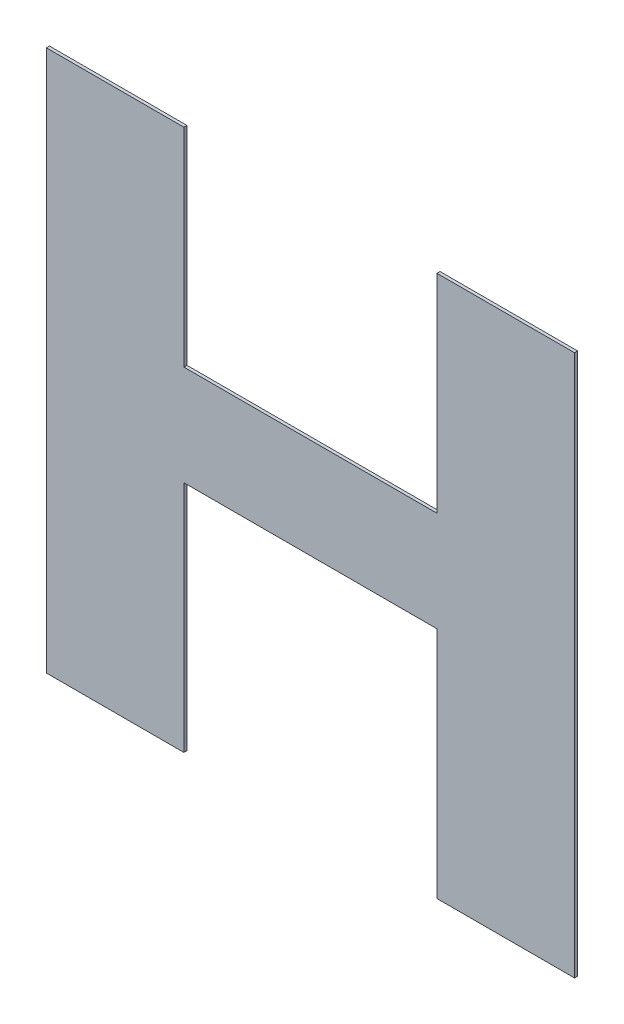
ISO-10303-21;
HEADER;
FILE_DESCRIPTION(('STEP AP214'),'2;1');
FILE_NAME('part.step','',(''),(''),'','','');
FILE_SCHEMA(('AUTOMOTIVE_DESIGN { 1 0 10303 214 1 1 1 1 }'));
ENDSEC;
DATA;
#1=APPLICATION_CONTEXT('core data for automotive mechanical design processes');
#2=APPLICATION_PROTOCOL_DEFINITION('international standard','automotive_design',2000,#1);
#3=PRODUCT_CONTEXT('',#1,'mechanical');
#4=PRODUCT('Part','Part','',(#3));
#5=PRODUCT_RELATED_PRODUCT_CATEGORY('part','',(#4));
#6=PRODUCT_DEFINITION_FORMATION('','',#4);
#7=PRODUCT_DEFINITION_CONTEXT('part definition',#1,'design');
#8=PRODUCT_DEFINITION('design','',#6,#7);
#9=PRODUCT_DEFINITION_SHAPE('','',#8);
#10=(LENGTH_UNIT() NAMED_UNIT(*) SI_UNIT(.MILLI.,.METRE.));
#11=(NAMED_UNIT(*) PLANE_ANGLE_UNIT() SI_UNIT($,.RADIAN.));
#12=(NAMED_UNIT(*) SI_UNIT($,.STERADIAN.) SOLID_ANGLE_UNIT());
#13=UNCERTAINTY_MEASURE_WITH_UNIT(LENGTH_MEASURE(1.E-05),#10,'distance_accuracy_value','');
#14=(GEOMETRIC_REPRESENTATION_CONTEXT(3) GLOBAL_UNCERTAINTY_ASSIGNED_CONTEXT((#13)) GLOBAL_UNIT_ASSIGNED_CONTEXT((#10,
#11,#12)) REPRESENTATION_CONTEXT('',''));
#15=CARTESIAN_POINT('',(0.,0.,0.));
#16=DIRECTION('',(0.,0.,1.));
#17=DIRECTION('',(1.,0.,0.));
#18=AXIS2_PLACEMENT_3D('',#15,#16,#17);
#19=CARTESIAN_POINT('',(-0.0548329304740127,0.85207054274705,0.00045));
#20=DIRECTION('',(0.,1.,0.));
#21=DIRECTION('',(0.,0.,1.));
#22=AXIS2_PLACEMENT_3D('',#19,#20,#21);
#23=PLANE('',#22);
#24=DIRECTION('',(0.,0.,1.));
#25=VECTOR('',#24,1.);
#26=CARTESIAN_POINT('',(-0.0648358536990002,0.85207054274705,0.));
#27=LINE('',#26,#25);
#28=CARTESIAN_POINT('',(-0.0648358536990002,0.85207054274705,0.));
#29=VERTEX_POINT('',#28);
#30=CARTESIAN_POINT('',(-0.0648358536990002,0.85207054274705,0.00045));
#31=VERTEX_POINT('',#30);
#32=EDGE_CURVE('E11',#29,#31,#27,.T.);
#33=ORIENTED_EDGE('',*,*,#32,.T.);
#34=DIRECTION('',(1.,0.,0.));
#35=VECTOR('',#34,1.);
#36=CARTESIAN_POINT('',(-0.0648358536990002,0.85207054274705,0.00045));
#37=LINE('',#36,#35);
#38=CARTESIAN_POINT('',(-0.0448300072490252,0.85207054274705,0.00045));
#39=VERTEX_POINT('',#38);
#40=EDGE_CURVE('E199',#31,#39,#37,.T.);
#41=ORIENTED_EDGE('',*,*,#40,.T.);
#42=DIRECTION('',(0.,0.,1.));
#43=VECTOR('',#42,1.);
#44=CARTESIAN_POINT('',(-0.0448300072490252,0.85207054274705,0.));
#45=LINE('',#44,#43);
#46=CARTESIAN_POINT('',(-0.0448300072490252,0.85207054274705,0.));
#47=VERTEX_POINT('',#46);
#48=EDGE_CURVE('E24',#47,#39,#45,.T.);
#49=ORIENTED_EDGE('',*,*,#48,.F.);
#50=DIRECTION('',(1.,0.,0.));
#51=VECTOR('',#50,1.);
#52=CARTESIAN_POINT('',(-0.0648358536990002,0.85207054274705,0.));
#53=LINE('',#52,#51);
#54=EDGE_CURVE('E188',#29,#47,#53,.T.);
#55=ORIENTED_EDGE('',*,*,#54,.F.);
#56=EDGE_LOOP('',(#33,#41,#49,#55));
#57=FACE_BOUND('',#56,.T.);
#58=ADVANCED_FACE('F17',(#57),#23,.T.);
#59=CARTESIAN_POINT('',(-0.0448300072490252,0.836954923689525,0.00045));
#60=DIRECTION('',(1.,0.,0.));
#61=DIRECTION('',(0.,0.,-1.));
#62=AXIS2_PLACEMENT_3D('',#59,#60,#61);
#63=PLANE('',#62);
#64=ORIENTED_EDGE('',*,*,#48,.T.);
#65=DIRECTION('',(0.,-1.,0.));
#66=VECTOR('',#65,1.);
#67=CARTESIAN_POINT('',(-0.0448300072490252,0.85207054274705,0.00045));
#68=LINE('',#67,#66);
#69=CARTESIAN_POINT('',(-0.0448300072490252,0.821839304632,0.00045));
#70=VERTEX_POINT('',#69);
#71=EDGE_CURVE('E195',#39,#70,#68,.T.);
#72=ORIENTED_EDGE('',*,*,#71,.T.);
#73=DIRECTION('',(0.,0.,1.));
#74=VECTOR('',#73,1.);
#75=CARTESIAN_POINT('',(-0.0448300072490252,0.821839304632,0.));
#76=LINE('',#75,#74);
#77=CARTESIAN_POINT('',(-0.0448300072490252,0.821839304632,0.));
#78=VERTEX_POINT('',#77);
#79=EDGE_CURVE('E197',#78,#70,#76,.T.);
#80=ORIENTED_EDGE('',*,*,#79,.F.);
#81=DIRECTION('',(0.,-1.,0.));
#82=VECTOR('',#81,1.);
#83=CARTESIAN_POINT('',(-0.0448300072490252,0.85207054274705,0.));
#84=LINE('',#83,#82);
#85=EDGE_CURVE('E180',#47,#78,#84,.T.);
#86=ORIENTED_EDGE('',*,*,#85,.F.);
#87=EDGE_LOOP('',(#64,#72,#80,#86));
#88=FACE_BOUND('',#87,.T.);
#89=ADVANCED_FACE('F206',(#88),#63,.T.);
#90=CARTESIAN_POINT('',(-0.0264129244489877,0.821839304632,0.00045));
#91=DIRECTION('',(0.,1.,0.));
#92=DIRECTION('',(0.,0.,1.));
#93=AXIS2_PLACEMENT_3D('',#90,#91,#92);
#94=PLANE('',#93);
#95=ORIENTED_EDGE('',*,*,#79,.T.);
#96=DIRECTION('',(1.,0.,0.));
#97=VECTOR('',#96,1.);
#98=CARTESIAN_POINT('',(-0.0448300072490252,0.821839304632,0.00045));
#99=LINE('',#98,#97);
#100=CARTESIAN_POINT('',(-0.00799584164895018,0.821839304632,0.00045));
#101=VERTEX_POINT('',#100);
#102=EDGE_CURVE('E190',#70,#101,#99,.T.);
#103=ORIENTED_EDGE('',*,*,#102,.T.);
#104=DIRECTION('',(0.,0.,1.));
#105=VECTOR('',#104,1.);
#106=CARTESIAN_POINT('',(-0.00799584164895018,0.821839304632,0.));
#107=LINE('',#106,#105);
#108=CARTESIAN_POINT('',(-0.00799584164895018,0.821839304632,0.));
#109=VERTEX_POINT('',#108);
#110=EDGE_CURVE('E193',#109,#101,#107,.T.);
#111=ORIENTED_EDGE('',*,*,#110,.F.);
#112=DIRECTION('',(1.,0.,0.));
#113=VECTOR('',#112,1.);
#114=CARTESIAN_POINT('',(-0.0448300072490252,0.821839304632,0.));
#115=LINE('',#114,#113);
#116=EDGE_CURVE('E172',#78,#109,#115,.T.);
#117=ORIENTED_EDGE('',*,*,#116,.F.);
#118=EDGE_LOOP('',(#95,#103,#111,#117));
#119=FACE_BOUND('',#118,.T.);
#120=ADVANCED_FACE('F209',(#119),#94,.T.);
#121=CARTESIAN_POINT('',(-0.00799584164895018,0.836954923689525,0.00045));
#122=DIRECTION('',(-1.,0.,0.));
#123=DIRECTION('',(0.,0.,1.));
#124=AXIS2_PLACEMENT_3D('',#121,#122,#123);
#125=PLANE('',#124);
#126=ORIENTED_EDGE('',*,*,#110,.T.);
#127=DIRECTION('',(0.,1.,0.));
#128=VECTOR('',#127,1.);
#129=CARTESIAN_POINT('',(-0.00799584164895018,0.821839304632,0.00045));
#130=LINE('',#129,#128);
#131=CARTESIAN_POINT('',(-0.00799584164895018,0.85207054274705,0.00045));
#132=VERTEX_POINT('',#131);
#133=EDGE_CURVE('E183',#101,#132,#130,.T.);
#134=ORIENTED_EDGE('',*,*,#133,.T.);
#135=DIRECTION('',(0.,0.,1.));
#136=VECTOR('',#135,1.);
#137=CARTESIAN_POINT('',(-0.00799584164895018,0.85207054274705,0.));
#138=LINE('',#137,#136);
#139=CARTESIAN_POINT('',(-0.00799584164895018,0.85207054274705,0.));
#140=VERTEX_POINT('',#139);
#141=EDGE_CURVE('E186',#140,#132,#138,.T.);
#142=ORIENTED_EDGE('',*,*,#141,.F.);
#143=DIRECTION('',(0.,1.,0.));
#144=VECTOR('',#143,1.);
#145=CARTESIAN_POINT('',(-0.00799584164895018,0.821839304632,0.));
#146=LINE('',#145,#144);
#147=EDGE_CURVE('E164',#109,#140,#146,.T.);
#148=ORIENTED_EDGE('',*,*,#147,.F.);
#149=EDGE_LOOP('',(#126,#134,#142,#148));
#150=FACE_BOUND('',#149,.T.);
#151=ADVANCED_FACE('F213',(#150),#125,.T.);
#152=CARTESIAN_POINT('',(0.00201012957599981,0.85207054274705,0.00045));
#153=DIRECTION('',(0.,1.,0.));
#154=DIRECTION('',(0.,0.,1.));
#155=AXIS2_PLACEMENT_3D('',#152,#153,#154);
#156=PLANE('',#155);
#157=ORIENTED_EDGE('',*,*,#141,.T.);
#158=DIRECTION('',(1.,0.,0.));
#159=VECTOR('',#158,1.);
#160=CARTESIAN_POINT('',(-0.00799584164895018,0.85207054274705,0.00045));
#161=LINE('',#160,#159);
#162=CARTESIAN_POINT('',(0.0120161008009498,0.85207054274705,0.00045));
#163=VERTEX_POINT('',#162);
#164=EDGE_CURVE('E175',#132,#163,#161,.T.);
#165=ORIENTED_EDGE('',*,*,#164,.T.);
#166=DIRECTION('',(0.,0.,1.));
#167=VECTOR('',#166,1.);
#168=CARTESIAN_POINT('',(0.0120161008009498,0.85207054274705,0.));
#169=LINE('',#168,#167);
#170=CARTESIAN_POINT('',(0.0120161008009498,0.85207054274705,0.));
#171=VERTEX_POINT('',#170);
#172=EDGE_CURVE('E178',#171,#163,#169,.T.);
#173=ORIENTED_EDGE('',*,*,#172,.F.);
#174=DIRECTION('',(1.,0.,0.));
#175=VECTOR('',#174,1.);
#176=CARTESIAN_POINT('',(-0.00799584164895018,0.85207054274705,0.));
#177=LINE('',#176,#175);
#178=EDGE_CURVE('E156',#140,#171,#177,.T.);
#179=ORIENTED_EDGE('',*,*,#178,.F.);
#180=EDGE_LOOP('',(#157,#165,#173,#179));
#181=FACE_BOUND('',#180,.T.);
#182=ADVANCED_FACE('F216',(#181),#156,.T.);
#183=CARTESIAN_POINT('',(0.0120161008009498,0.8126754605645,0.00045));
#184=DIRECTION('',(1.,0.,0.));
#185=DIRECTION('',(0.,0.,-1.));
#186=AXIS2_PLACEMENT_3D('',#183,#184,#185);
#187=PLANE('',#186);
#188=ORIENTED_EDGE('',*,*,#172,.T.);
#189=DIRECTION('',(0.,-1.,0.));
#190=VECTOR('',#189,1.);
#191=CARTESIAN_POINT('',(0.0120161008009498,0.85207054274705,0.00045));
#192=LINE('',#191,#190);
#193=CARTESIAN_POINT('',(0.0120161008009498,0.77328037838195,0.00045));
#194=VERTEX_POINT('',#193);
#195=EDGE_CURVE('E167',#163,#194,#192,.T.);
#196=ORIENTED_EDGE('',*,*,#195,.T.);
#197=DIRECTION('',(0.,0.,1.));
#198=VECTOR('',#197,1.);
#199=CARTESIAN_POINT('',(0.0120161008009498,0.77328037838195,0.));
#200=LINE('',#199,#198);
#201=CARTESIAN_POINT('',(0.0120161008009498,0.77328037838195,0.));
#202=VERTEX_POINT('',#201);
#203=EDGE_CURVE('E170',#202,#194,#200,.T.);
#204=ORIENTED_EDGE('',*,*,#203,.F.);
#205=DIRECTION('',(0.,-1.,0.));
#206=VECTOR('',#205,1.);
#207=CARTESIAN_POINT('',(0.0120161008009498,0.85207054274705,0.));
#208=LINE('',#207,#206);
#209=EDGE_CURVE('E148',#171,#202,#208,.T.);
#210=ORIENTED_EDGE('',*,*,#209,.F.);
#211=EDGE_LOOP('',(#188,#196,#204,#210));
#212=FACE_BOUND('',#211,.T.);
#213=ADVANCED_FACE('F220',(#212),#187,.T.);
#214=CARTESIAN_POINT('',(0.00201012957599981,0.77328037838195,0.00045));
#215=DIRECTION('',(0.,-1.,0.));
#216=DIRECTION('',(0.,0.,-1.));
#217=AXIS2_PLACEMENT_3D('',#214,#215,#216);
#218=PLANE('',#217);
#219=ORIENTED_EDGE('',*,*,#203,.T.);
#220=DIRECTION('',(-1.,0.,0.));
#221=VECTOR('',#220,1.);
#222=CARTESIAN_POINT('',(0.0120161008009498,0.77328037838195,0.00045));
#223=LINE('',#222,#221);
#224=CARTESIAN_POINT('',(-0.00799584164895018,0.77328037838195,0.00045));
#225=VERTEX_POINT('',#224);
#226=EDGE_CURVE('E159',#194,#225,#223,.T.);
#227=ORIENTED_EDGE('',*,*,#226,.T.);
#228=DIRECTION('',(0.,0.,1.));
#229=VECTOR('',#228,1.);
#230=CARTESIAN_POINT('',(-0.00799584164895018,0.77328037838195,0.));
#231=LINE('',#230,#229);
#232=CARTESIAN_POINT('',(-0.00799584164895018,0.77328037838195,0.));
#233=VERTEX_POINT('',#232);
#234=EDGE_CURVE('E162',#233,#225,#231,.T.);
#235=ORIENTED_EDGE('',*,*,#234,.F.);
#236=DIRECTION('',(-1.,0.,0.));
#237=VECTOR('',#236,1.);
#238=CARTESIAN_POINT('',(0.0120161008009498,0.77328037838195,0.));
#239=LINE('',#238,#237);
#240=EDGE_CURVE('E140',#202,#233,#239,.T.);
#241=ORIENTED_EDGE('',*,*,#240,.F.);
#242=EDGE_LOOP('',(#219,#227,#235,#241));
#243=FACE_BOUND('',#242,.T.);
#244=ADVANCED_FACE('F224',(#243),#218,.T.);
#245=CARTESIAN_POINT('',(-0.00799584164895018,0.790276307051974,0.00045));
#246=DIRECTION('',(-1.,0.,0.));
#247=DIRECTION('',(0.,0.,1.));
#248=AXIS2_PLACEMENT_3D('',#245,#246,#247);
#249=PLANE('',#248);
#250=ORIENTED_EDGE('',*,*,#234,.T.);
#251=DIRECTION('',(0.,1.,0.));
#252=VECTOR('',#251,1.);
#253=CARTESIAN_POINT('',(-0.00799584164895018,0.77328037838195,0.00045));
#254=LINE('',#253,#252);
#255=CARTESIAN_POINT('',(-0.00799584164895018,0.807272235721999,0.00045));
#256=VERTEX_POINT('',#255);
#257=EDGE_CURVE('E151',#225,#256,#254,.T.);
#258=ORIENTED_EDGE('',*,*,#257,.T.);
#259=DIRECTION('',(0.,0.,1.));
#260=VECTOR('',#259,1.);
#261=CARTESIAN_POINT('',(-0.00799584164895018,0.807272235721999,0.));
#262=LINE('',#261,#260);
#263=CARTESIAN_POINT('',(-0.00799584164895018,0.807272235721999,0.));
#264=VERTEX_POINT('',#263);
#265=EDGE_CURVE('E154',#264,#256,#262,.T.);
#266=ORIENTED_EDGE('',*,*,#265,.F.);
#267=DIRECTION('',(0.,1.,0.));
#268=VECTOR('',#267,1.);
#269=CARTESIAN_POINT('',(-0.00799584164895018,0.77328037838195,0.));
#270=LINE('',#269,#268);
#271=EDGE_CURVE('E113',#233,#264,#270,.T.);
#272=ORIENTED_EDGE('',*,*,#271,.F.);
#273=EDGE_LOOP('',(#250,#258,#266,#272));
#274=FACE_BOUND('',#273,.T.);
#275=ADVANCED_FACE('F228',(#274),#249,.T.);
#276=CARTESIAN_POINT('',(-0.0264129244489877,0.807272235721999,0.00045));
#277=DIRECTION('',(0.,-1.,0.));
#278=DIRECTION('',(0.,0.,-1.));
#279=AXIS2_PLACEMENT_3D('',#276,#277,#278);
#280=PLANE('',#279);
#281=ORIENTED_EDGE('',*,*,#265,.T.);
#282=DIRECTION('',(-1.,0.,0.));
#283=VECTOR('',#282,1.);
#284=CARTESIAN_POINT('',(-0.00799584164895018,0.807272235721999,0.00045));
#285=LINE('',#284,#283);
#286=CARTESIAN_POINT('',(-0.0448300072490252,0.807272235721999,0.00045));
#287=VERTEX_POINT('',#286);
#288=EDGE_CURVE('E143',#256,#287,#285,.T.);
#289=ORIENTED_EDGE('',*,*,#288,.T.);
#290=DIRECTION('',(0.,0.,1.));
#291=VECTOR('',#290,1.);
#292=CARTESIAN_POINT('',(-0.0448300072490252,0.807272235721999,0.));
#293=LINE('',#292,#291);
#294=CARTESIAN_POINT('',(-0.0448300072490252,0.807272235721999,0.));
#295=VERTEX_POINT('',#294);
#296=EDGE_CURVE('E146',#295,#287,#293,.T.);
#297=ORIENTED_EDGE('',*,*,#296,.F.);
#298=DIRECTION('',(-1.,0.,0.));
#299=VECTOR('',#298,1.);
#300=CARTESIAN_POINT('',(-0.00799584164895018,0.807272235721999,0.));
#301=LINE('',#300,#299);
#302=EDGE_CURVE('E130',#264,#295,#301,.T.);
#303=ORIENTED_EDGE('',*,*,#302,.F.);
#304=EDGE_LOOP('',(#281,#289,#297,#303));
#305=FACE_BOUND('',#304,.T.);
#306=ADVANCED_FACE('F232',(#305),#280,.T.);
#307=CARTESIAN_POINT('',(-0.0448300072490252,0.790276307051974,0.00045));
#308=DIRECTION('',(1.,0.,0.));
#309=DIRECTION('',(0.,0.,-1.));
#310=AXIS2_PLACEMENT_3D('',#307,#308,#309);
#311=PLANE('',#310);
#312=ORIENTED_EDGE('',*,*,#296,.T.);
#313=DIRECTION('',(0.,-1.,0.));
#314=VECTOR('',#313,1.);
#315=CARTESIAN_POINT('',(-0.0448300072490252,0.807272235721999,0.00045));
#316=LINE('',#315,#314);
#317=CARTESIAN_POINT('',(-0.0448300072490252,0.77328037838195,0.00045));
#318=VERTEX_POINT('',#317);
#319=EDGE_CURVE('E135',#287,#318,#316,.T.);
#320=ORIENTED_EDGE('',*,*,#319,.T.);
#321=DIRECTION('',(0.,0.,1.));
#322=VECTOR('',#321,1.);
#323=CARTESIAN_POINT('',(-0.0448300072490252,0.77328037838195,0.));
#324=LINE('',#323,#322);
#325=CARTESIAN_POINT('',(-0.0448300072490252,0.77328037838195,0.));
#326=VERTEX_POINT('',#325);
#327=EDGE_CURVE('E138',#326,#318,#324,.T.);
#328=ORIENTED_EDGE('',*,*,#327,.F.);
#329=DIRECTION('',(0.,-1.,0.));
#330=VECTOR('',#329,1.);
#331=CARTESIAN_POINT('',(-0.0448300072490252,0.807272235721999,0.));
#332=LINE('',#331,#330);
#333=EDGE_CURVE('E124',#295,#326,#332,.T.);
#334=ORIENTED_EDGE('',*,*,#333,.F.);
#335=EDGE_LOOP('',(#312,#320,#328,#334));
#336=FACE_BOUND('',#335,.T.);
#337=ADVANCED_FACE('F235',(#336),#311,.T.);
#338=CARTESIAN_POINT('',(-0.0548329304740127,0.77328037838195,0.00045));
#339=DIRECTION('',(0.,-1.,0.));
#340=DIRECTION('',(0.,0.,-1.));
#341=AXIS2_PLACEMENT_3D('',#338,#339,#340);
#342=PLANE('',#341);
#343=ORIENTED_EDGE('',*,*,#327,.T.);
#344=DIRECTION('',(-1.,0.,0.));
#345=VECTOR('',#344,1.);
#346=CARTESIAN_POINT('',(-0.0448300072490252,0.77328037838195,0.00045));
#347=LINE('',#346,#345);
#348=CARTESIAN_POINT('',(-0.0648358536990002,0.77328037838195,0.00045));
#349=VERTEX_POINT('',#348);
#350=EDGE_CURVE('E110',#318,#349,#347,.T.);
#351=ORIENTED_EDGE('',*,*,#350,.T.);
#352=DIRECTION('',(0.,0.,1.));
#353=VECTOR('',#352,1.);
#354=CARTESIAN_POINT('',(-0.0648358536990002,0.77328037838195,0.));
#355=LINE('',#354,#353);
#356=CARTESIAN_POINT('',(-0.0648358536990002,0.77328037838195,0.));
#357=VERTEX_POINT('',#356);
#358=EDGE_CURVE('E103',#357,#349,#355,.T.);
#359=ORIENTED_EDGE('',*,*,#358,.F.);
#360=DIRECTION('',(-1.,0.,0.));
#361=VECTOR('',#360,1.);
#362=CARTESIAN_POINT('',(-0.0448300072490252,0.77328037838195,0.));
#363=LINE('',#362,#361);
#364=EDGE_CURVE('E107',#326,#357,#363,.T.);
#365=ORIENTED_EDGE('',*,*,#364,.F.);
#366=EDGE_LOOP('',(#343,#351,#359,#365));
#367=FACE_BOUND('',#366,.T.);
#368=ADVANCED_FACE('F105',(#367),#342,.T.);
#369=CARTESIAN_POINT('',(-0.0648358536990002,0.8126754605645,0.00045));
#370=DIRECTION('',(-1.,0.,0.));
#371=DIRECTION('',(0.,0.,1.));
#372=AXIS2_PLACEMENT_3D('',#369,#370,#371);
#373=PLANE('',#372);
#374=ORIENTED_EDGE('',*,*,#358,.T.);
#375=DIRECTION('',(0.,1.,0.));
#376=VECTOR('',#375,1.);
#377=CARTESIAN_POINT('',(-0.0648358536990002,0.77328037838195,0.00045));
#378=LINE('',#377,#376);
#379=EDGE_CURVE('E126',#349,#31,#378,.T.);
#380=ORIENTED_EDGE('',*,*,#379,.T.);
#381=ORIENTED_EDGE('',*,*,#32,.F.);
#382=DIRECTION('',(0.,1.,0.));
#383=VECTOR('',#382,1.);
#384=CARTESIAN_POINT('',(-0.0648358536990002,0.77328037838195,0.));
#385=LINE('',#384,#383);
#386=EDGE_CURVE('E116',#357,#29,#385,.T.);
#387=ORIENTED_EDGE('',*,*,#386,.F.);
#388=EDGE_LOOP('',(#374,#380,#381,#387));
#389=FACE_BOUND('',#388,.T.);
#390=ADVANCED_FACE('F117',(#389),#373,.T.);
#391=CARTESIAN_POINT('',(-0.0264098764490252,0.77328037838195,0.));
#392=DIRECTION('',(0.,0.,1.));
#393=DIRECTION('',(1.,0.,0.));
#394=AXIS2_PLACEMENT_3D('',#391,#392,#393);
#395=PLANE('',#394);
#396=ORIENTED_EDGE('',*,*,#54,.T.);
#397=ORIENTED_EDGE('',*,*,#85,.T.);
#398=ORIENTED_EDGE('',*,*,#116,.T.);
#399=ORIENTED_EDGE('',*,*,#147,.T.);
#400=ORIENTED_EDGE('',*,*,#178,.T.);
#401=ORIENTED_EDGE('',*,*,#209,.T.);
#402=ORIENTED_EDGE('',*,*,#240,.T.);
#403=ORIENTED_EDGE('',*,*,#271,.T.);
#404=ORIENTED_EDGE('',*,*,#302,.T.);
#405=ORIENTED_EDGE('',*,*,#333,.T.);
#406=ORIENTED_EDGE('',*,*,#364,.T.);
#407=ORIENTED_EDGE('',*,*,#386,.T.);
#408=EDGE_LOOP('',(#396,#397,#398,#399,#400,#401,#402,#403,#404,#405,#406,#407));
#409=FACE_BOUND('',#408,.T.);
#410=ADVANCED_FACE('F121',(#409),#395,.F.);
#411=CARTESIAN_POINT('',(-0.0264098764490252,0.77328037838195,0.00045));
#412=DIRECTION('',(0.,0.,1.));
#413=DIRECTION('',(1.,0.,0.));
#414=AXIS2_PLACEMENT_3D('',#411,#412,#413);
#415=PLANE('',#414);
#416=ORIENTED_EDGE('',*,*,#40,.F.);
#417=ORIENTED_EDGE('',*,*,#379,.F.);
#418=ORIENTED_EDGE('',*,*,#350,.F.);
#419=ORIENTED_EDGE('',*,*,#319,.F.);
#420=ORIENTED_EDGE('',*,*,#288,.F.);
#421=ORIENTED_EDGE('',*,*,#257,.F.);
#422=ORIENTED_EDGE('',*,*,#226,.F.);
#423=ORIENTED_EDGE('',*,*,#195,.F.);
#424=ORIENTED_EDGE('',*,*,#164,.F.);
#425=ORIENTED_EDGE('',*,*,#133,.F.);
#426=ORIENTED_EDGE('',*,*,#102,.F.);
#427=ORIENTED_EDGE('',*,*,#71,.F.);
#428=EDGE_LOOP('',(#416,#417,#418,#419,#420,#421,#422,#423,#424,#425,#426,#427));
#429=FACE_BOUND('',#428,.T.);
#430=ADVANCED_FACE('F204',(#429),#415,.T.);
#431=CLOSED_SHELL('',(#58,#89,#120,#151,#182,#213,#244,#275,#306,#337,#368,#390,#410,#430));
#432=MANIFOLD_SOLID_BREP('B1',#431);
#433=ADVANCED_BREP_SHAPE_REPRESENTATION('',(#18,#432),#14);
#434=SHAPE_DEFINITION_REPRESENTATION(#9,#433);
ENDSEC;
END-ISO-10303-21;
